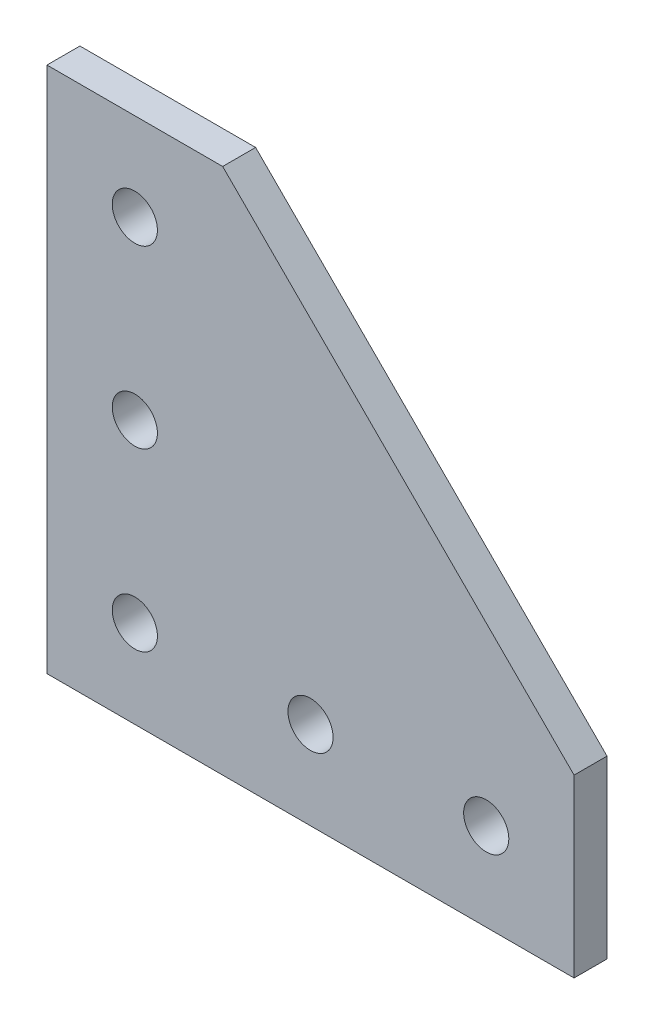
ISO-10303-21;
HEADER;
FILE_DESCRIPTION(('STEP AP214'),'2;1');
FILE_NAME('part.step','',(''),(''),'','','');
FILE_SCHEMA(('AUTOMOTIVE_DESIGN { 1 0 10303 214 1 1 1 1 }'));
ENDSEC;
DATA;
#1=APPLICATION_CONTEXT('core data for automotive mechanical design processes');
#2=APPLICATION_PROTOCOL_DEFINITION('international standard','automotive_design',2000,#1);
#3=PRODUCT_CONTEXT('',#1,'mechanical');
#4=PRODUCT('Part','Part','',(#3));
#5=PRODUCT_RELATED_PRODUCT_CATEGORY('part','',(#4));
#6=PRODUCT_DEFINITION_FORMATION('','',#4);
#7=PRODUCT_DEFINITION_CONTEXT('part definition',#1,'design');
#8=PRODUCT_DEFINITION('design','',#6,#7);
#9=PRODUCT_DEFINITION_SHAPE('','',#8);
#10=(LENGTH_UNIT() NAMED_UNIT(*) SI_UNIT(.MILLI.,.METRE.));
#11=(NAMED_UNIT(*) PLANE_ANGLE_UNIT() SI_UNIT($,.RADIAN.));
#12=(NAMED_UNIT(*) SI_UNIT($,.STERADIAN.) SOLID_ANGLE_UNIT());
#13=UNCERTAINTY_MEASURE_WITH_UNIT(LENGTH_MEASURE(1.E-05),#10,'distance_accuracy_value','');
#14=(GEOMETRIC_REPRESENTATION_CONTEXT(3) GLOBAL_UNCERTAINTY_ASSIGNED_CONTEXT((#13)) GLOBAL_UNIT_ASSIGNED_CONTEXT((#10,
#11,#12)) REPRESENTATION_CONTEXT('',''));
#15=CARTESIAN_POINT('',(0.,0.,0.));
#16=DIRECTION('',(0.,0.,1.));
#17=DIRECTION('',(1.,0.,0.));
#18=AXIS2_PLACEMENT_3D('',#15,#16,#17);
#19=CARTESIAN_POINT('',(0.,0.,2.38125));
#20=DIRECTION('',(0.,0.,-1.));
#21=DIRECTION('',(-1.,0.,0.));
#22=AXIS2_PLACEMENT_3D('',#19,#20,#21);
#23=PLANE('',#22);
#24=CARTESIAN_POINT('',(12.7,63.5,2.38125));
#25=DIRECTION('',(0.,0.,1.));
#26=DIRECTION('',(1.,0.,0.));
#27=AXIS2_PLACEMENT_3D('',#24,#25,#26);
#28=CIRCLE('',#27,3.2639);
#29=CARTESIAN_POINT('',(15.9639,63.5,2.38125));
#30=VERTEX_POINT('',#29);
#31=EDGE_CURVE('E209',#30,#30,#28,.T.);
#32=ORIENTED_EDGE('',*,*,#31,.F.);
#33=EDGE_LOOP('',(#32));
#34=FACE_BOUND('',#33,.T.);
#35=CARTESIAN_POINT('',(38.1,12.7,2.38125));
#36=DIRECTION('',(0.,0.,1.));
#37=DIRECTION('',(1.,0.,0.));
#38=AXIS2_PLACEMENT_3D('',#35,#36,#37);
#39=CIRCLE('',#38,3.26389999999999);
#40=CARTESIAN_POINT('',(41.3639,12.7,2.38125));
#41=VERTEX_POINT('',#40);
#42=EDGE_CURVE('E224',#41,#41,#39,.T.);
#43=ORIENTED_EDGE('',*,*,#42,.F.);
#44=EDGE_LOOP('',(#43));
#45=FACE_BOUND('',#44,.T.);
#46=DIRECTION('',(1.,0.,0.));
#47=VECTOR('',#46,1.);
#48=CARTESIAN_POINT('',(76.2,0.,2.38125));
#49=LINE('',#48,#47);
#50=CARTESIAN_POINT('',(0.,0.,2.38125));
#51=VERTEX_POINT('',#50);
#52=CARTESIAN_POINT('',(76.2,0.,2.38125));
#53=VERTEX_POINT('',#52);
#54=EDGE_CURVE('E143',#51,#53,#49,.T.);
#55=ORIENTED_EDGE('',*,*,#54,.T.);
#56=DIRECTION('',(0.,1.,0.));
#57=VECTOR('',#56,1.);
#58=CARTESIAN_POINT('',(76.2,25.4,2.38125));
#59=LINE('',#58,#57);
#60=CARTESIAN_POINT('',(76.2,25.4,2.38125));
#61=VERTEX_POINT('',#60);
#62=EDGE_CURVE('E99',#53,#61,#59,.T.);
#63=ORIENTED_EDGE('',*,*,#62,.T.);
#64=DIRECTION('',(-0.707106781186547,0.707106781186547,0.));
#65=VECTOR('',#64,1.);
#66=CARTESIAN_POINT('',(76.2,25.4,2.38125));
#67=LINE('',#66,#65);
#68=CARTESIAN_POINT('',(25.4,76.2,2.38125));
#69=VERTEX_POINT('',#68);
#70=EDGE_CURVE('E104',#61,#69,#67,.T.);
#71=ORIENTED_EDGE('',*,*,#70,.T.);
#72=DIRECTION('',(-1.,0.,0.));
#73=VECTOR('',#72,1.);
#74=CARTESIAN_POINT('',(0.,76.2,2.38125));
#75=LINE('',#74,#73);
#76=CARTESIAN_POINT('',(0.,76.2,2.38125));
#77=VERTEX_POINT('',#76);
#78=EDGE_CURVE('E108',#69,#77,#75,.T.);
#79=ORIENTED_EDGE('',*,*,#78,.T.);
#80=DIRECTION('',(0.,-1.,0.));
#81=VECTOR('',#80,1.);
#82=CARTESIAN_POINT('',(0.,0.,2.38125));
#83=LINE('',#82,#81);
#84=EDGE_CURVE('E59',#77,#51,#83,.T.);
#85=ORIENTED_EDGE('',*,*,#84,.T.);
#86=EDGE_LOOP('',(#55,#63,#71,#79,#85));
#87=FACE_BOUND('',#86,.T.);
#88=CARTESIAN_POINT('',(12.7,12.7,2.38125));
#89=DIRECTION('',(0.,0.,1.));
#90=DIRECTION('',(1.,0.,0.));
#91=AXIS2_PLACEMENT_3D('',#88,#89,#90);
#92=CIRCLE('',#91,3.2639);
#93=CARTESIAN_POINT('',(15.9639,12.7,2.38125));
#94=VERTEX_POINT('',#93);
#95=EDGE_CURVE('E135',#94,#94,#92,.T.);
#96=ORIENTED_EDGE('',*,*,#95,.F.);
#97=EDGE_LOOP('',(#96));
#98=FACE_BOUND('',#97,.T.);
#99=CARTESIAN_POINT('',(63.5,12.7,2.38125));
#100=DIRECTION('',(0.,0.,1.));
#101=DIRECTION('',(1.,0.,0.));
#102=AXIS2_PLACEMENT_3D('',#99,#100,#101);
#103=CIRCLE('',#102,3.26389999999999);
#104=CARTESIAN_POINT('',(66.7639,12.7,2.38125));
#105=VERTEX_POINT('',#104);
#106=EDGE_CURVE('E217',#105,#105,#103,.T.);
#107=ORIENTED_EDGE('',*,*,#106,.F.);
#108=EDGE_LOOP('',(#107));
#109=FACE_BOUND('',#108,.T.);
#110=CARTESIAN_POINT('',(12.7,38.1,2.38125));
#111=DIRECTION('',(0.,0.,1.));
#112=DIRECTION('',(1.,0.,0.));
#113=AXIS2_PLACEMENT_3D('',#110,#111,#112);
#114=CIRCLE('',#113,3.26389999999999);
#115=CARTESIAN_POINT('',(15.9639,38.1,2.38125));
#116=VERTEX_POINT('',#115);
#117=EDGE_CURVE('E197',#116,#116,#114,.T.);
#118=ORIENTED_EDGE('',*,*,#117,.F.);
#119=EDGE_LOOP('',(#118));
#120=FACE_BOUND('',#119,.T.);
#121=ADVANCED_FACE('F38',(#34,#45,#87,#98,#109,#120),#23,.F.);
#122=CARTESIAN_POINT('',(0.,0.,-2.38125));
#123=DIRECTION('',(0.,0.,-1.));
#124=DIRECTION('',(-1.,0.,0.));
#125=AXIS2_PLACEMENT_3D('',#122,#123,#124);
#126=PLANE('',#125);
#127=CARTESIAN_POINT('',(12.7,63.5,-2.38125));
#128=DIRECTION('',(0.,0.,1.));
#129=DIRECTION('',(1.,0.,0.));
#130=AXIS2_PLACEMENT_3D('',#127,#128,#129);
#131=CIRCLE('',#130,3.2639);
#132=CARTESIAN_POINT('',(15.9639,63.5,-2.38125));
#133=VERTEX_POINT('',#132);
#134=EDGE_CURVE('E206',#133,#133,#131,.T.);
#135=ORIENTED_EDGE('',*,*,#134,.T.);
#136=EDGE_LOOP('',(#135));
#137=FACE_BOUND('',#136,.T.);
#138=CARTESIAN_POINT('',(38.1,12.7,-2.38125));
#139=DIRECTION('',(0.,0.,1.));
#140=DIRECTION('',(1.,0.,0.));
#141=AXIS2_PLACEMENT_3D('',#138,#139,#140);
#142=CIRCLE('',#141,3.26389999999999);
#143=CARTESIAN_POINT('',(41.3639,12.7,-2.38125));
#144=VERTEX_POINT('',#143);
#145=EDGE_CURVE('E220',#144,#144,#142,.T.);
#146=ORIENTED_EDGE('',*,*,#145,.T.);
#147=EDGE_LOOP('',(#146));
#148=FACE_BOUND('',#147,.T.);
#149=DIRECTION('',(1.,0.,0.));
#150=VECTOR('',#149,1.);
#151=CARTESIAN_POINT('',(76.2,0.,-2.38125));
#152=LINE('',#151,#150);
#153=CARTESIAN_POINT('',(0.,0.,-2.38125));
#154=VERTEX_POINT('',#153);
#155=CARTESIAN_POINT('',(76.2,0.,-2.38125));
#156=VERTEX_POINT('',#155);
#157=EDGE_CURVE('E130',#154,#156,#152,.T.);
#158=ORIENTED_EDGE('',*,*,#157,.F.);
#159=DIRECTION('',(0.,-1.,0.));
#160=VECTOR('',#159,1.);
#161=CARTESIAN_POINT('',(0.,0.,-2.38125));
#162=LINE('',#161,#160);
#163=CARTESIAN_POINT('',(0.,76.2,-2.38125));
#164=VERTEX_POINT('',#163);
#165=EDGE_CURVE('E90',#164,#154,#162,.T.);
#166=ORIENTED_EDGE('',*,*,#165,.F.);
#167=DIRECTION('',(-1.,0.,0.));
#168=VECTOR('',#167,1.);
#169=CARTESIAN_POINT('',(0.,76.2,-2.38125));
#170=LINE('',#169,#168);
#171=CARTESIAN_POINT('',(25.4,76.2,-2.38125));
#172=VERTEX_POINT('',#171);
#173=EDGE_CURVE('E84',#172,#164,#170,.T.);
#174=ORIENTED_EDGE('',*,*,#173,.F.);
#175=DIRECTION('',(-0.707106781186547,0.707106781186547,0.));
#176=VECTOR('',#175,1.);
#177=CARTESIAN_POINT('',(76.2,25.4,-2.38125));
#178=LINE('',#177,#176);
#179=CARTESIAN_POINT('',(76.2,25.4,-2.38125));
#180=VERTEX_POINT('',#179);
#181=EDGE_CURVE('E116',#180,#172,#178,.T.);
#182=ORIENTED_EDGE('',*,*,#181,.F.);
#183=DIRECTION('',(0.,1.,0.));
#184=VECTOR('',#183,1.);
#185=CARTESIAN_POINT('',(76.2,25.4,-2.38125));
#186=LINE('',#185,#184);
#187=EDGE_CURVE('E134',#156,#180,#186,.T.);
#188=ORIENTED_EDGE('',*,*,#187,.F.);
#189=EDGE_LOOP('',(#158,#166,#174,#182,#188));
#190=FACE_BOUND('',#189,.T.);
#191=CARTESIAN_POINT('',(12.7,12.7,-2.38125));
#192=DIRECTION('',(0.,0.,1.));
#193=DIRECTION('',(1.,0.,0.));
#194=AXIS2_PLACEMENT_3D('',#191,#192,#193);
#195=CIRCLE('',#194,3.2639);
#196=CARTESIAN_POINT('',(15.9639,12.7,-2.38125));
#197=VERTEX_POINT('',#196);
#198=EDGE_CURVE('E228',#197,#197,#195,.T.);
#199=ORIENTED_EDGE('',*,*,#198,.T.);
#200=EDGE_LOOP('',(#199));
#201=FACE_BOUND('',#200,.T.);
#202=CARTESIAN_POINT('',(63.5,12.7,-2.38125));
#203=DIRECTION('',(0.,0.,1.));
#204=DIRECTION('',(1.,0.,0.));
#205=AXIS2_PLACEMENT_3D('',#202,#203,#204);
#206=CIRCLE('',#205,3.26389999999999);
#207=CARTESIAN_POINT('',(66.7639,12.7,-2.38125));
#208=VERTEX_POINT('',#207);
#209=EDGE_CURVE('E213',#208,#208,#206,.T.);
#210=ORIENTED_EDGE('',*,*,#209,.T.);
#211=EDGE_LOOP('',(#210));
#212=FACE_BOUND('',#211,.T.);
#213=CARTESIAN_POINT('',(12.7,38.1,-2.38125));
#214=DIRECTION('',(0.,0.,1.));
#215=DIRECTION('',(1.,0.,0.));
#216=AXIS2_PLACEMENT_3D('',#213,#214,#215);
#217=CIRCLE('',#216,3.26389999999999);
#218=CARTESIAN_POINT('',(15.9639,38.1,-2.38125));
#219=VERTEX_POINT('',#218);
#220=EDGE_CURVE('E200',#219,#219,#217,.T.);
#221=ORIENTED_EDGE('',*,*,#220,.T.);
#222=EDGE_LOOP('',(#221));
#223=FACE_BOUND('',#222,.T.);
#224=ADVANCED_FACE('F150',(#137,#148,#190,#201,#212,#223),#126,.T.);
#225=CARTESIAN_POINT('',(76.2,0.,2.38125));
#226=DIRECTION('',(0.,1.,0.));
#227=DIRECTION('',(-1.,0.,0.));
#228=AXIS2_PLACEMENT_3D('',#225,#226,#227);
#229=PLANE('',#228);
#230=ORIENTED_EDGE('',*,*,#157,.T.);
#231=DIRECTION('',(0.,0.,-1.));
#232=VECTOR('',#231,1.);
#233=CARTESIAN_POINT('',(76.2,0.,2.38125));
#234=LINE('',#233,#232);
#235=EDGE_CURVE('E11',#53,#156,#234,.T.);
#236=ORIENTED_EDGE('',*,*,#235,.F.);
#237=ORIENTED_EDGE('',*,*,#54,.F.);
#238=DIRECTION('',(0.,0.,-1.));
#239=VECTOR('',#238,1.);
#240=CARTESIAN_POINT('',(0.,0.,2.38125));
#241=LINE('',#240,#239);
#242=EDGE_CURVE('E126',#51,#154,#241,.T.);
#243=ORIENTED_EDGE('',*,*,#242,.T.);
#244=EDGE_LOOP('',(#230,#236,#237,#243));
#245=FACE_BOUND('',#244,.T.);
#246=ADVANCED_FACE('F40',(#245),#229,.F.);
#247=CARTESIAN_POINT('',(76.2,25.4,2.38125));
#248=DIRECTION('',(-1.,0.,0.));
#249=DIRECTION('',(0.,0.,1.));
#250=AXIS2_PLACEMENT_3D('',#247,#248,#249);
#251=PLANE('',#250);
#252=ORIENTED_EDGE('',*,*,#187,.T.);
#253=DIRECTION('',(0.,0.,-1.));
#254=VECTOR('',#253,1.);
#255=CARTESIAN_POINT('',(76.2,25.4,2.38125));
#256=LINE('',#255,#254);
#257=EDGE_CURVE('E48',#61,#180,#256,.T.);
#258=ORIENTED_EDGE('',*,*,#257,.F.);
#259=ORIENTED_EDGE('',*,*,#62,.F.);
#260=ORIENTED_EDGE('',*,*,#235,.T.);
#261=EDGE_LOOP('',(#252,#258,#259,#260));
#262=FACE_BOUND('',#261,.T.);
#263=ADVANCED_FACE('F300',(#262),#251,.F.);
#264=CARTESIAN_POINT('',(76.2,25.4,2.38125));
#265=DIRECTION('',(-0.707106781186547,-0.707106781186547,0.));
#266=DIRECTION('',(0.707106781186548,-0.707106781186548,0.));
#267=AXIS2_PLACEMENT_3D('',#264,#265,#266);
#268=PLANE('',#267);
#269=ORIENTED_EDGE('',*,*,#181,.T.);
#270=DIRECTION('',(0.,0.,-1.));
#271=VECTOR('',#270,1.);
#272=CARTESIAN_POINT('',(25.4,76.2,2.38125));
#273=LINE('',#272,#271);
#274=EDGE_CURVE('E113',#69,#172,#273,.T.);
#275=ORIENTED_EDGE('',*,*,#274,.F.);
#276=ORIENTED_EDGE('',*,*,#70,.F.);
#277=ORIENTED_EDGE('',*,*,#257,.T.);
#278=EDGE_LOOP('',(#269,#275,#276,#277));
#279=FACE_BOUND('',#278,.T.);
#280=ADVANCED_FACE('F114',(#279),#268,.F.);
#281=CARTESIAN_POINT('',(0.,76.2,2.38125));
#282=DIRECTION('',(0.,-1.,0.));
#283=DIRECTION('',(0.,0.,-1.));
#284=AXIS2_PLACEMENT_3D('',#281,#282,#283);
#285=PLANE('',#284);
#286=ORIENTED_EDGE('',*,*,#173,.T.);
#287=DIRECTION('',(0.,0.,-1.));
#288=VECTOR('',#287,1.);
#289=CARTESIAN_POINT('',(0.,76.2,2.38125));
#290=LINE('',#289,#288);
#291=EDGE_CURVE('E118',#77,#164,#290,.T.);
#292=ORIENTED_EDGE('',*,*,#291,.F.);
#293=ORIENTED_EDGE('',*,*,#78,.F.);
#294=ORIENTED_EDGE('',*,*,#274,.T.);
#295=EDGE_LOOP('',(#286,#292,#293,#294));
#296=FACE_BOUND('',#295,.T.);
#297=ADVANCED_FACE('F120',(#296),#285,.F.);
#298=CARTESIAN_POINT('',(0.,0.,2.38125));
#299=DIRECTION('',(1.,0.,0.));
#300=DIRECTION('',(0.,0.,-1.));
#301=AXIS2_PLACEMENT_3D('',#298,#299,#300);
#302=PLANE('',#301);
#303=ORIENTED_EDGE('',*,*,#165,.T.);
#304=ORIENTED_EDGE('',*,*,#242,.F.);
#305=ORIENTED_EDGE('',*,*,#84,.F.);
#306=ORIENTED_EDGE('',*,*,#291,.T.);
#307=EDGE_LOOP('',(#303,#304,#305,#306));
#308=FACE_BOUND('',#307,.T.);
#309=ADVANCED_FACE('F155',(#308),#302,.F.);
#310=CARTESIAN_POINT('',(12.7,12.7,2.38125));
#311=DIRECTION('',(0.,0.,-1.));
#312=DIRECTION('',(-1.,0.,0.));
#313=AXIS2_PLACEMENT_3D('',#310,#311,#312);
#314=CYLINDRICAL_SURFACE('',#313,3.2639);
#315=ORIENTED_EDGE('',*,*,#95,.T.);
#316=EDGE_LOOP('',(#315));
#317=FACE_BOUND('',#316,.T.);
#318=ORIENTED_EDGE('',*,*,#198,.F.);
#319=EDGE_LOOP('',(#318));
#320=FACE_BOUND('',#319,.T.);
#321=ADVANCED_FACE('F157',(#317,#320),#314,.F.);
#322=CARTESIAN_POINT('',(38.1,12.7,2.38125));
#323=DIRECTION('',(0.,0.,-1.));
#324=DIRECTION('',(-1.,0.,0.));
#325=AXIS2_PLACEMENT_3D('',#322,#323,#324);
#326=CYLINDRICAL_SURFACE('',#325,3.26389999999999);
#327=ORIENTED_EDGE('',*,*,#42,.T.);
#328=EDGE_LOOP('',(#327));
#329=FACE_BOUND('',#328,.T.);
#330=ORIENTED_EDGE('',*,*,#145,.F.);
#331=EDGE_LOOP('',(#330));
#332=FACE_BOUND('',#331,.T.);
#333=ADVANCED_FACE('F163',(#329,#332),#326,.F.);
#334=CARTESIAN_POINT('',(63.5,12.7,2.38125));
#335=DIRECTION('',(0.,0.,-1.));
#336=DIRECTION('',(-1.,0.,0.));
#337=AXIS2_PLACEMENT_3D('',#334,#335,#336);
#338=CYLINDRICAL_SURFACE('',#337,3.26389999999999);
#339=ORIENTED_EDGE('',*,*,#106,.T.);
#340=EDGE_LOOP('',(#339));
#341=FACE_BOUND('',#340,.T.);
#342=ORIENTED_EDGE('',*,*,#209,.F.);
#343=EDGE_LOOP('',(#342));
#344=FACE_BOUND('',#343,.T.);
#345=ADVANCED_FACE('F180',(#341,#344),#338,.F.);
#346=CARTESIAN_POINT('',(12.7,63.5,2.38125));
#347=DIRECTION('',(0.,0.,-1.));
#348=DIRECTION('',(-1.,0.,0.));
#349=AXIS2_PLACEMENT_3D('',#346,#347,#348);
#350=CYLINDRICAL_SURFACE('',#349,3.2639);
#351=ORIENTED_EDGE('',*,*,#31,.T.);
#352=EDGE_LOOP('',(#351));
#353=FACE_BOUND('',#352,.T.);
#354=ORIENTED_EDGE('',*,*,#134,.F.);
#355=EDGE_LOOP('',(#354));
#356=FACE_BOUND('',#355,.T.);
#357=ADVANCED_FACE('F184',(#353,#356),#350,.F.);
#358=CARTESIAN_POINT('',(12.7,38.1,2.38125));
#359=DIRECTION('',(0.,0.,-1.));
#360=DIRECTION('',(-1.,0.,0.));
#361=AXIS2_PLACEMENT_3D('',#358,#359,#360);
#362=CYLINDRICAL_SURFACE('',#361,3.26389999999999);
#363=ORIENTED_EDGE('',*,*,#117,.T.);
#364=EDGE_LOOP('',(#363));
#365=FACE_BOUND('',#364,.T.);
#366=ORIENTED_EDGE('',*,*,#220,.F.);
#367=EDGE_LOOP('',(#366));
#368=FACE_BOUND('',#367,.T.);
#369=ADVANCED_FACE('F188',(#365,#368),#362,.F.);
#370=CLOSED_SHELL('',(#121,#224,#246,#263,#280,#297,#309,#321,#333,#345,#357,#369));
#371=MANIFOLD_SOLID_BREP('B2',#370);
#372=ADVANCED_BREP_SHAPE_REPRESENTATION('',(#18,#371),#14);
#373=SHAPE_DEFINITION_REPRESENTATION(#9,#372);
ENDSEC;
END-ISO-10303-21;
